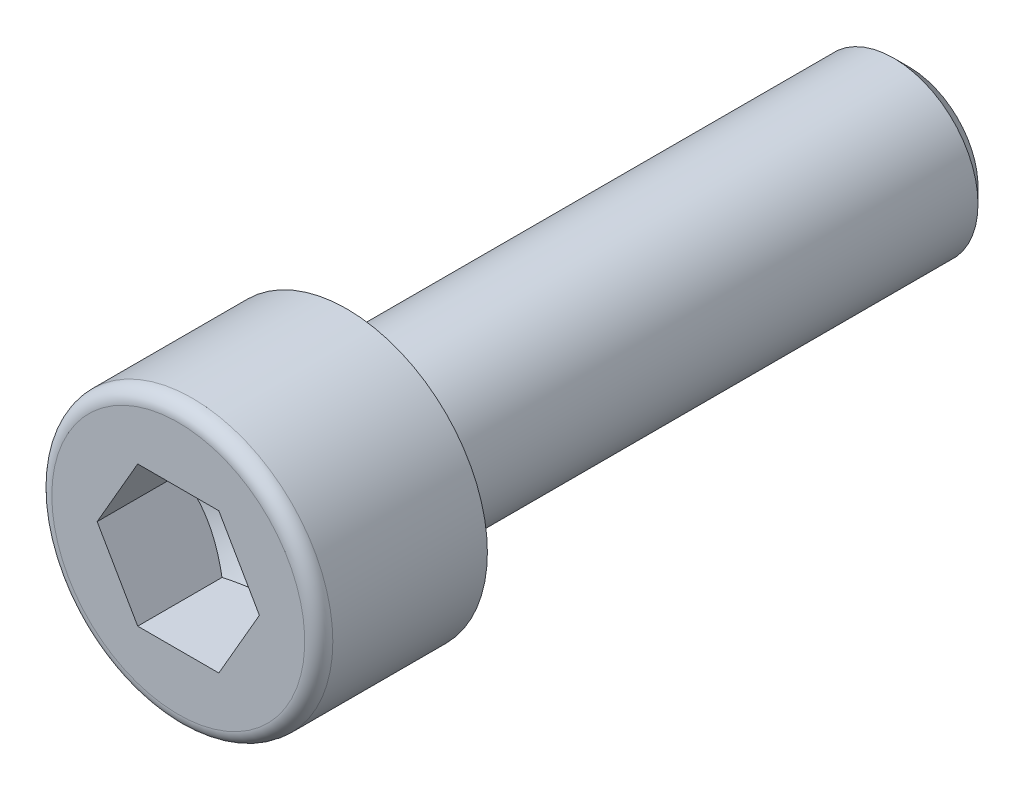
ISO-10303-21;
HEADER;
FILE_DESCRIPTION(('STEP AP214'),'2;1');
FILE_NAME('part.step','',(''),(''),'','','');
FILE_SCHEMA(('AUTOMOTIVE_DESIGN { 1 0 10303 214 1 1 1 1 }'));
ENDSEC;
DATA;
#1=APPLICATION_CONTEXT('core data for automotive mechanical design processes');
#2=APPLICATION_PROTOCOL_DEFINITION('international standard','automotive_design',2000,#1);
#3=PRODUCT_CONTEXT('',#1,'mechanical');
#4=PRODUCT('Part','Part','',(#3));
#5=PRODUCT_RELATED_PRODUCT_CATEGORY('part','',(#4));
#6=PRODUCT_DEFINITION_FORMATION('','',#4);
#7=PRODUCT_DEFINITION_CONTEXT('part definition',#1,'design');
#8=PRODUCT_DEFINITION('design','',#6,#7);
#9=PRODUCT_DEFINITION_SHAPE('','',#8);
#10=(LENGTH_UNIT() NAMED_UNIT(*) SI_UNIT(.MILLI.,.METRE.));
#11=(NAMED_UNIT(*) PLANE_ANGLE_UNIT() SI_UNIT($,.RADIAN.));
#12=(NAMED_UNIT(*) SI_UNIT($,.STERADIAN.) SOLID_ANGLE_UNIT());
#13=UNCERTAINTY_MEASURE_WITH_UNIT(LENGTH_MEASURE(1.E-05),#10,'distance_accuracy_value','');
#14=(GEOMETRIC_REPRESENTATION_CONTEXT(3) GLOBAL_UNCERTAINTY_ASSIGNED_CONTEXT((#13)) GLOBAL_UNIT_ASSIGNED_CONTEXT((#10,
#11,#12)) REPRESENTATION_CONTEXT('',''));
#15=CARTESIAN_POINT('',(0.,0.,0.));
#16=DIRECTION('',(0.,0.,1.));
#17=DIRECTION('',(1.,0.,0.));
#18=AXIS2_PLACEMENT_3D('',#15,#16,#17);
#19=CARTESIAN_POINT('',(0.,0.,0.));
#20=DIRECTION('',(0.,0.,1.));
#21=DIRECTION('',(1.,0.,0.));
#22=AXIS2_PLACEMENT_3D('',#19,#20,#21);
#23=PLANE('',#22);
#24=CARTESIAN_POINT('',(0.,0.,0.));
#25=DIRECTION('',(0.,0.,1.));
#26=DIRECTION('',(1.,0.,0.));
#27=AXIS2_PLACEMENT_3D('',#24,#25,#26);
#28=CIRCLE('',#27,5.);
#29=CARTESIAN_POINT('',(5.,0.,0.));
#30=VERTEX_POINT('',#29);
#31=EDGE_CURVE('E146',#30,#30,#28,.T.);
#32=ORIENTED_EDGE('',*,*,#31,.F.);
#33=EDGE_LOOP('',(#32));
#34=FACE_BOUND('',#33,.T.);
#35=CARTESIAN_POINT('',(0.,0.,0.));
#36=DIRECTION('',(0.,0.,1.));
#37=DIRECTION('',(1.,0.,0.));
#38=AXIS2_PLACEMENT_3D('',#35,#36,#37);
#39=CIRCLE('',#38,3.);
#40=CARTESIAN_POINT('',(3.,0.,0.));
#41=VERTEX_POINT('',#40);
#42=EDGE_CURVE('E151',#41,#41,#39,.F.);
#43=ORIENTED_EDGE('',*,*,#42,.F.);
#44=EDGE_LOOP('',(#43));
#45=FACE_BOUND('',#44,.T.);
#46=ADVANCED_FACE('F43',(#34,#45),#23,.F.);
#47=CARTESIAN_POINT('',(0.,4.5,6.));
#48=DIRECTION('',(0.,0.,-1.));
#49=DIRECTION('',(-1.,0.,0.));
#50=AXIS2_PLACEMENT_3D('',#47,#48,#49);
#51=PLANE('',#50);
#52=CARTESIAN_POINT('',(0.,0.,6.));
#53=DIRECTION('',(0.,0.,-1.));
#54=DIRECTION('',(-1.,0.,0.));
#55=AXIS2_PLACEMENT_3D('',#52,#53,#54);
#56=CIRCLE('',#55,4.5);
#57=CARTESIAN_POINT('',(-4.5,0.,6.));
#58=VERTEX_POINT('',#57);
#59=EDGE_CURVE('E51',#58,#58,#56,.F.);
#60=ORIENTED_EDGE('',*,*,#59,.T.);
#61=EDGE_LOOP('',(#60));
#62=FACE_BOUND('',#61,.T.);
#63=DIRECTION('',(0.5,-0.866025403784439,0.));
#64=VECTOR('',#63,1.);
#65=CARTESIAN_POINT('',(1.443375,2.49999883437473,6.));
#66=LINE('',#65,#64);
#67=CARTESIAN_POINT('',(1.443375,2.49999883437473,6.));
#68=VERTEX_POINT('',#67);
#69=CARTESIAN_POINT('',(2.88675,0.,6.));
#70=VERTEX_POINT('',#69);
#71=EDGE_CURVE('E58',#68,#70,#66,.T.);
#72=ORIENTED_EDGE('',*,*,#71,.T.);
#73=DIRECTION('',(-0.5,-0.866025403784439,0.));
#74=VECTOR('',#73,1.);
#75=CARTESIAN_POINT('',(2.88675,0.,6.));
#76=LINE('',#75,#74);
#77=CARTESIAN_POINT('',(1.443375,-2.49999883437473,6.));
#78=VERTEX_POINT('',#77);
#79=EDGE_CURVE('E175',#70,#78,#76,.T.);
#80=ORIENTED_EDGE('',*,*,#79,.T.);
#81=DIRECTION('',(-1.,0.,0.));
#82=VECTOR('',#81,1.);
#83=CARTESIAN_POINT('',(1.443375,-2.49999883437473,6.));
#84=LINE('',#83,#82);
#85=CARTESIAN_POINT('',(-1.443375,-2.49999883437473,6.));
#86=VERTEX_POINT('',#85);
#87=EDGE_CURVE('E271',#78,#86,#84,.T.);
#88=ORIENTED_EDGE('',*,*,#87,.T.);
#89=DIRECTION('',(-0.5,0.866025403784439,0.));
#90=VECTOR('',#89,1.);
#91=CARTESIAN_POINT('',(-1.443375,-2.49999883437473,6.));
#92=LINE('',#91,#90);
#93=CARTESIAN_POINT('',(-2.88675,0.,6.));
#94=VERTEX_POINT('',#93);
#95=EDGE_CURVE('E275',#86,#94,#92,.T.);
#96=ORIENTED_EDGE('',*,*,#95,.T.);
#97=DIRECTION('',(0.5,0.866025403784439,0.));
#98=VECTOR('',#97,1.);
#99=CARTESIAN_POINT('',(-2.88675,0.,6.));
#100=LINE('',#99,#98);
#101=CARTESIAN_POINT('',(-1.443375,2.49999883437473,6.));
#102=VERTEX_POINT('',#101);
#103=EDGE_CURVE('E130',#94,#102,#100,.T.);
#104=ORIENTED_EDGE('',*,*,#103,.T.);
#105=DIRECTION('',(1.,0.,0.));
#106=VECTOR('',#105,1.);
#107=CARTESIAN_POINT('',(-1.443375,2.49999883437473,6.));
#108=LINE('',#107,#106);
#109=EDGE_CURVE('E122',#102,#68,#108,.T.);
#110=ORIENTED_EDGE('',*,*,#109,.T.);
#111=EDGE_LOOP('',(#72,#80,#88,#96,#104,#110));
#112=FACE_BOUND('',#111,.T.);
#113=ADVANCED_FACE('F230',(#62,#112),#51,.F.);
#114=CARTESIAN_POINT('',(0.,0.,6.));
#115=DIRECTION('',(0.,0.,1.));
#116=DIRECTION('',(1.,0.,0.));
#117=AXIS2_PLACEMENT_3D('',#114,#115,#116);
#118=CYLINDRICAL_SURFACE('',#117,5.);
#119=CARTESIAN_POINT('',(0.,0.,5.5));
#120=DIRECTION('',(0.,0.,-1.));
#121=DIRECTION('',(-1.,0.,0.));
#122=AXIS2_PLACEMENT_3D('',#119,#120,#121);
#123=CIRCLE('',#122,5.);
#124=CARTESIAN_POINT('',(-5.,0.,5.5));
#125=VERTEX_POINT('',#124);
#126=EDGE_CURVE('E12',#125,#125,#123,.T.);
#127=ORIENTED_EDGE('',*,*,#126,.T.);
#128=EDGE_LOOP('',(#127));
#129=FACE_BOUND('',#128,.T.);
#130=ORIENTED_EDGE('',*,*,#31,.T.);
#131=EDGE_LOOP('',(#130));
#132=FACE_BOUND('',#131,.T.);
#133=ADVANCED_FACE('F228',(#129,#132),#118,.T.);
#134=CARTESIAN_POINT('',(1.443375,2.49999883437473,1.33333411041685));
#135=DIRECTION('',(-0.866025403784439,-0.5,0.));
#136=DIRECTION('',(-0.5,0.866025403784438,0.));
#137=AXIS2_PLACEMENT_3D('',#134,#135,#136);
#138=PLANE('',#137);
#139=DIRECTION('',(0.,0.,1.));
#140=VECTOR('',#139,1.);
#141=CARTESIAN_POINT('',(2.88675,0.,1.33333411041685));
#142=LINE('',#141,#140);
#143=CARTESIAN_POINT('',(2.88675,0.,3.));
#144=VERTEX_POINT('',#143);
#145=EDGE_CURVE('E143',#144,#70,#142,.T.);
#146=ORIENTED_EDGE('',*,*,#145,.T.);
#147=ORIENTED_EDGE('',*,*,#71,.F.);
#148=DIRECTION('',(0.,0.,1.));
#149=VECTOR('',#148,1.);
#150=CARTESIAN_POINT('',(1.443375,2.49999883437473,1.33333411041685));
#151=LINE('',#150,#149);
#152=CARTESIAN_POINT('',(1.443375,2.49999883437473,3.));
#153=VERTEX_POINT('',#152);
#154=EDGE_CURVE('E115',#153,#68,#151,.T.);
#155=ORIENTED_EDGE('',*,*,#154,.F.);
#156=CARTESIAN_POINT('',(2.88675115470054,-2.E-06,3.00000066666707));
#157=CARTESIAN_POINT('',(2.82332354535897,0.109857841982227,2.96337006039726));
#158=CARTESIAN_POINT('',(2.75934842983882,0.220665992483223,2.93005643273496));
#159=CARTESIAN_POINT('',(2.63029051087885,0.444200865240994,2.87190847700775));
#160=CARTESIAN_POINT('',(2.56520541506427,0.556931558007335,2.84709471727335));
#161=CARTESIAN_POINT('',(2.4358417909861,0.78099592756197,2.8084702850323));
#162=CARTESIAN_POINT('',(2.37158316147789,0.892295138694932,2.79440251599447));
#163=CARTESIAN_POINT('',(2.24276369983448,1.11541699126498,2.77761163079658));
#164=CARTESIAN_POINT('',(2.17820333560637,1.22723882226323,2.77487460704407));
#165=CARTESIAN_POINT('',(2.05757906871724,1.43616618114094,2.7805828840092));
#166=CARTESIAN_POINT('',(2.00149706603362,1.53330305917919,2.78762661346734));
#167=CARTESIAN_POINT('',(1.88969841687931,1.72694399973201,2.8099466525033));
#168=CARTESIAN_POINT('',(1.83398215680598,1.82344739298676,2.82523057920943));
#169=CARTESIAN_POINT('',(1.72195318911858,2.01748725694082,2.86343746342627));
#170=CARTESIAN_POINT('',(1.66565465323697,2.1149991814795,2.88652230296935));
#171=CARTESIAN_POINT('',(1.55389703460282,2.30856905508676,2.93891513912548));
#172=CARTESIAN_POINT('',(1.49843652119396,2.40462948212476,2.96821083329068));
#173=CARTESIAN_POINT('',(1.44337384529946,2.50000083437473,3.00000066666707));
#174=B_SPLINE_CURVE_WITH_KNOTS('',3,(#156,#157,#158,#159,#160,#161,#162,#163,#164,#165,#166,
#167,#168,#169,#170,#171,#172,#173),.UNSPECIFIED.,.F.,.F.,(4,2,2,2,2,2,2,2,4),(0.,
0.396269987805477,0.793492221888839,1.1808844206854,1.56780098500208,1.90463546712439,
2.24178184973835,2.58640455505215,2.93035090593904),.UNSPECIFIED.);
#175=EDGE_CURVE('E107',#144,#153,#174,.T.);
#176=ORIENTED_EDGE('',*,*,#175,.F.);
#177=EDGE_LOOP('',(#146,#147,#155,#176));
#178=FACE_BOUND('',#177,.T.);
#179=ADVANCED_FACE('F116',(#178),#138,.T.);
#180=CARTESIAN_POINT('',(2.88675,0.,1.33333411041685));
#181=DIRECTION('',(-0.866025403784439,0.5,0.));
#182=DIRECTION('',(0.5,0.866025403784439,0.));
#183=AXIS2_PLACEMENT_3D('',#180,#181,#182);
#184=PLANE('',#183);
#185=DIRECTION('',(0.,0.,1.));
#186=VECTOR('',#185,1.);
#187=CARTESIAN_POINT('',(1.443375,-2.49999883437473,1.33333411041685));
#188=LINE('',#187,#186);
#189=CARTESIAN_POINT('',(1.443375,-2.49999883437473,3.));
#190=VERTEX_POINT('',#189);
#191=EDGE_CURVE('E140',#190,#78,#188,.T.);
#192=ORIENTED_EDGE('',*,*,#191,.T.);
#193=ORIENTED_EDGE('',*,*,#79,.F.);
#194=ORIENTED_EDGE('',*,*,#145,.F.);
#195=CARTESIAN_POINT('',(1.44337384529946,-2.50000083437473,3.00000066666707));
#196=CARTESIAN_POINT('',(1.50680145464103,-2.3901409923925,2.96337006039726));
#197=CARTESIAN_POINT('',(1.57077657016118,-2.27933284189151,2.93005643273496));
#198=CARTESIAN_POINT('',(1.69983448912115,-2.05579796913373,2.87190847700775));
#199=CARTESIAN_POINT('',(1.76491958493573,-1.94306727636739,2.84709471727335));
#200=CARTESIAN_POINT('',(1.8942832090139,-1.71900290681276,2.8084702850323));
#201=CARTESIAN_POINT('',(1.95854183852211,-1.6077036956798,2.79440251599447));
#202=CARTESIAN_POINT('',(2.08736130016552,-1.38458184310974,2.77761163079658));
#203=CARTESIAN_POINT('',(2.15192166439363,-1.2727600121115,2.77487460704408));
#204=CARTESIAN_POINT('',(2.27254593128276,-1.06383265323379,2.7805828840092));
#205=CARTESIAN_POINT('',(2.32862793396638,-0.966695775195541,2.78762661346734));
#206=CARTESIAN_POINT('',(2.44042658312069,-0.773054834642715,2.8099466525033));
#207=CARTESIAN_POINT('',(2.49614284319403,-0.676551441387972,2.82523057920943));
#208=CARTESIAN_POINT('',(2.60817181088142,-0.482511577433911,2.86343746342627));
#209=CARTESIAN_POINT('',(2.66447034676303,-0.384999652895224,2.88652230296935));
#210=CARTESIAN_POINT('',(2.77622796539718,-0.191429779287974,2.93891513912548));
#211=CARTESIAN_POINT('',(2.83168847880604,-0.0953693522499732,2.96821083329068));
#212=CARTESIAN_POINT('',(2.88675115470054,2.00000000025213E-06,3.00000066666707));
#213=B_SPLINE_CURVE_WITH_KNOTS('',3,(#195,#196,#197,#198,#199,#200,#201,#202,#203,#204,#205,
#206,#207,#208,#209,#210,#211,#212),.UNSPECIFIED.,.F.,.F.,(4,2,2,2,2,2,2,2,4),(0.,
0.396269987805478,0.79349222188884,1.1808844206854,1.56780098500208,1.90463546712439,
2.24178184973836,2.58640455505215,2.93035090593904),.UNSPECIFIED.);
#214=EDGE_CURVE('E111',#190,#144,#213,.T.);
#215=ORIENTED_EDGE('',*,*,#214,.F.);
#216=EDGE_LOOP('',(#192,#193,#194,#215));
#217=FACE_BOUND('',#216,.T.);
#218=ADVANCED_FACE('F219',(#217),#184,.T.);
#219=CARTESIAN_POINT('',(1.443375,-2.49999883437473,1.33333411041685));
#220=DIRECTION('',(0.,1.,0.));
#221=DIRECTION('',(1.,0.,0.));
#222=AXIS2_PLACEMENT_3D('',#219,#220,#221);
#223=PLANE('',#222);
#224=DIRECTION('',(0.,0.,1.));
#225=VECTOR('',#224,1.);
#226=CARTESIAN_POINT('',(-1.443375,-2.49999883437473,1.33333411041685));
#227=LINE('',#226,#225);
#228=CARTESIAN_POINT('',(-1.443375,-2.49999883437473,3.));
#229=VERTEX_POINT('',#228);
#230=EDGE_CURVE('E137',#229,#86,#227,.T.);
#231=ORIENTED_EDGE('',*,*,#230,.T.);
#232=ORIENTED_EDGE('',*,*,#87,.F.);
#233=ORIENTED_EDGE('',*,*,#191,.F.);
#234=CARTESIAN_POINT('',(-3.73786106214979,-2.49999883437473,3.92958778907324));
#235=CARTESIAN_POINT('',(-3.62990250335969,-2.49999883437473,3.87779335774325));
#236=CARTESIAN_POINT('',(-3.52168094276801,-2.49999883437473,3.82653690477121));
#237=CARTESIAN_POINT('',(-3.30457164494513,-2.49999883437473,3.72540514162743));
#238=CARTESIAN_POINT('',(-3.19568379207403,-2.49999883437473,3.67553008001432));
#239=CARTESIAN_POINT('',(-2.9764774054262,-2.49999883437473,3.57718765766728));
#240=CARTESIAN_POINT('',(-2.86615419981139,-2.49999883437473,3.52873067133896));
#241=CARTESIAN_POINT('',(-2.64458202847932,-2.49999883437473,3.4339896311619));
#242=CARTESIAN_POINT('',(-2.53333311125245,-2.49999883437473,3.38770546433014));
#243=CARTESIAN_POINT('',(-2.30680205819545,-2.49999883437473,3.2967100755852));
#244=CARTESIAN_POINT('',(-2.19149052050016,-2.49999883437473,3.2520716190807));
#245=CARTESIAN_POINT('',(-1.95947266398433,-2.49999883437473,3.1665059843482));
#246=CARTESIAN_POINT('',(-1.84276618516189,-2.49999883437473,3.12557923657333));
#247=CARTESIAN_POINT('',(-1.60804233924781,-2.49999883437473,3.04860739009266));
#248=CARTESIAN_POINT('',(-1.49002871456052,-2.49999883437473,3.01255100191558));
#249=CARTESIAN_POINT('',(-1.25231014409633,-2.49999883437473,2.94655294839667));
#250=CARTESIAN_POINT('',(-1.13260562628878,-2.49999883437473,2.91660976441946));
#251=CARTESIAN_POINT('',(-0.891754624847682,-2.49999883437473,2.86443431611274));
#252=CARTESIAN_POINT('',(-0.770611640017906,-2.49999883437473,2.84218621451804));
#253=CARTESIAN_POINT('',(-0.526970339246118,-2.49999883437473,2.8068577746921));
#254=CARTESIAN_POINT('',(-0.404472115461951,-2.49999883437473,2.79377681692952));
#255=CARTESIAN_POINT('',(-0.160266323051493,-2.49999883437473,2.7779963214066));
#256=CARTESIAN_POINT('',(-0.0385668667227562,-2.49999883437473,2.77517427588141));
#257=CARTESIAN_POINT('',(0.204641816788917,-2.49999883437473,2.77983589012324));
#258=CARTESIAN_POINT('',(0.326151031726512,-2.49999883437473,2.78732018801759));
#259=CARTESIAN_POINT('',(0.536550258909014,-2.49999883437473,2.80869871352845));
#260=CARTESIAN_POINT('',(0.62567290534766,-2.49999883437473,2.82040889034712));
#261=CARTESIAN_POINT('',(0.80317291802574,-2.49999883437473,2.84856827951529));
#262=CARTESIAN_POINT('',(0.89155015258231,-2.49999883437473,2.86501831186796));
#263=CARTESIAN_POINT('',(1.15551819105506,-2.49999883437473,2.920608175745));
#264=CARTESIAN_POINT('',(1.32980784141715,-2.49999883437473,2.96597208143992));
#265=CARTESIAN_POINT('',(1.59042319619559,-2.49999883437473,3.04347409361569));
#266=CARTESIAN_POINT('',(1.6781227038712,-2.49999883437473,3.07124565241289));
#267=CARTESIAN_POINT('',(1.85261386594625,-2.49999883437473,3.12935698644029));
#268=CARTESIAN_POINT('',(1.93940604944137,-2.49999883437473,3.15969515890171));
#269=CARTESIAN_POINT('',(2.11219208096506,-2.49999883437473,3.2225001255257));
#270=CARTESIAN_POINT('',(2.19818607085344,-2.49999883437473,3.25496653284332));
#271=CARTESIAN_POINT('',(2.36949689943691,-2.49999883437473,3.32167630023758));
#272=CARTESIAN_POINT('',(2.4548136208992,-2.49999883437473,3.35591996053755));
#273=CARTESIAN_POINT('',(2.6725866434786,-2.49999883437473,3.44552247380957));
#274=CARTESIAN_POINT('',(2.80460719164756,-2.49999883437473,3.50193903020824));
#275=CARTESIAN_POINT('',(3.06745887456859,-2.49999883437473,3.61748626069377));
#276=CARTESIAN_POINT('',(3.19828991933625,-2.49999883437473,3.6766171381022));
#277=CARTESIAN_POINT('',(3.4590085358823,-2.49999883437473,3.79697662160321));
#278=CARTESIAN_POINT('',(3.58889593921384,-2.49999883437473,3.85820559158554));
#279=CARTESIAN_POINT('',(3.84788850349047,-2.49999883437473,3.98229871528446));
#280=CARTESIAN_POINT('',(3.97699364696087,-2.49999883437473,4.04516290536492));
#281=CARTESIAN_POINT('',(4.36366797006391,-2.49999883437473,4.23583166126771));
#282=CARTESIAN_POINT('',(4.62028446759073,-2.49999883437473,4.36556642178983));
#283=CARTESIAN_POINT('',(5.13176042686128,-2.49999883437473,4.62835386929467));
#284=CARTESIAN_POINT('',(5.38662010673858,-2.49999883437473,4.76140613453321));
#285=CARTESIAN_POINT('',(5.87112459117811,-2.49999883437473,5.01714634418064));
#286=CARTESIAN_POINT('',(6.10087887005075,-2.49999883437473,5.13962722061171));
#287=CARTESIAN_POINT('',(6.55964844430519,-2.49999883437473,5.38598343470431));
#288=CARTESIAN_POINT('',(6.78866371193351,-2.49999883437473,5.50985882397014));
#289=CARTESIAN_POINT('',(7.2455430452267,-2.49999883437473,5.75833902928913));
#290=CARTESIAN_POINT('',(7.47340855738404,-2.49999883437473,5.88294118863516));
#291=CARTESIAN_POINT('',(7.9286788902648,-2.49999883437473,6.13295649095833));
#292=CARTESIAN_POINT('',(8.156083734473,-2.49999883437473,6.25836959115399));
#293=CARTESIAN_POINT('',(8.38332307978598,-2.49999883437473,6.38407993098458));
#294=B_SPLINE_CURVE_WITH_KNOTS('',3,(#234,#235,#236,#237,#238,#239,#240,#241,#242,#243,#244,
#245,#246,#247,#248,#249,#250,#251,#252,#253,#254,#255,#256,#257,#258,#259,#260,#261,#262,#263,
#264,#265,#266,#267,#268,#269,#270,#271,#272,#273,#274,#275,#276,#277,#278,#279,#280,#281,#282,
#283,#284,#285,#286,#287,#288,#289,#290,#291,#292,#293),.UNSPECIFIED.,.F.,.F.,(4,2,2,2,2,2,2,2,
2,2,2,2,2,2,2,2,2,2,2,2,2,2,2,2,2,2,2,2,2,4),(0.,0.359225681612437,0.718515585501186,
1.07998495471943,1.44143550726446,1.81233642992121,2.18328031172541,2.553349025072,
2.92332569419794,3.29253631826214,3.66172198803058,4.02648423639168,4.39126907037958,
4.66080188357842,4.93038135444365,5.4699536049164,5.74590907322745,6.02169347043866,
6.29742787713709,6.57320901498075,7.00387400010299,7.43457129784687,7.86534367692857,
8.29612564369277,9.15872160396268,10.0212084586034,10.8022892260896,11.5833989933082,
12.3625220011586,13.1416042361018),.UNSPECIFIED.);
#295=EDGE_CURVE('E208',#229,#190,#294,.T.);
#296=ORIENTED_EDGE('',*,*,#295,.F.);
#297=EDGE_LOOP('',(#231,#232,#233,#296));
#298=FACE_BOUND('',#297,.T.);
#299=ADVANCED_FACE('F215',(#298),#223,.T.);
#300=CARTESIAN_POINT('',(-1.443375,-2.49999883437473,1.33333411041685));
#301=DIRECTION('',(0.866025403784439,0.5,0.));
#302=DIRECTION('',(0.5,-0.866025403784439,0.));
#303=AXIS2_PLACEMENT_3D('',#300,#301,#302);
#304=PLANE('',#303);
#305=DIRECTION('',(0.,0.,1.));
#306=VECTOR('',#305,1.);
#307=CARTESIAN_POINT('',(-2.88675,0.,1.33333411041685));
#308=LINE('',#307,#306);
#309=CARTESIAN_POINT('',(-2.88675,0.,3.));
#310=VERTEX_POINT('',#309);
#311=EDGE_CURVE('E128',#310,#94,#308,.T.);
#312=ORIENTED_EDGE('',*,*,#311,.T.);
#313=ORIENTED_EDGE('',*,*,#95,.F.);
#314=ORIENTED_EDGE('',*,*,#230,.F.);
#315=CARTESIAN_POINT('',(-2.88675115470054,2.00000000083267E-06,3.00000066666707));
#316=CARTESIAN_POINT('',(-2.82332354535897,-0.109857841982226,2.96337006039727));
#317=CARTESIAN_POINT('',(-2.75934842983882,-0.220665992483222,2.93005643273496));
#318=CARTESIAN_POINT('',(-2.63029051087885,-0.444200865240993,2.87190847700775));
#319=CARTESIAN_POINT('',(-2.56520541506427,-0.556931558007334,2.84709471727335));
#320=CARTESIAN_POINT('',(-2.4358417909861,-0.780995927561968,2.8084702850323));
#321=CARTESIAN_POINT('',(-2.37158316147789,-0.89229513869493,2.79440251599447));
#322=CARTESIAN_POINT('',(-2.24276369983448,-1.11541699126498,2.77761163079658));
#323=CARTESIAN_POINT('',(-2.17820333560637,-1.22723882226323,2.77487460704408));
#324=CARTESIAN_POINT('',(-2.05757906871724,-1.43616618114094,2.7805828840092));
#325=CARTESIAN_POINT('',(-2.00149706603362,-1.53330305917919,2.78762661346734));
#326=CARTESIAN_POINT('',(-1.88969841687931,-1.72694399973201,2.8099466525033));
#327=CARTESIAN_POINT('',(-1.83398215680598,-1.82344739298676,2.82523057920943));
#328=CARTESIAN_POINT('',(-1.72195318911858,-2.01748725694082,2.86343746342627));
#329=CARTESIAN_POINT('',(-1.66565465323697,-2.1149991814795,2.88652230296935));
#330=CARTESIAN_POINT('',(-1.55389703460282,-2.30856905508676,2.93891513912548));
#331=CARTESIAN_POINT('',(-1.49843652119396,-2.40462948212476,2.96821083329068));
#332=CARTESIAN_POINT('',(-1.44337384529946,-2.50000083437473,3.00000066666707));
#333=B_SPLINE_CURVE_WITH_KNOTS('',3,(#315,#316,#317,#318,#319,#320,#321,#322,#323,#324,#325,
#326,#327,#328,#329,#330,#331,#332),.UNSPECIFIED.,.F.,.F.,(4,2,2,2,2,2,2,2,4),(0.,
0.396269987805478,0.793492221888839,1.1808844206854,1.56780098500208,1.90463546712439,
2.24178184973836,2.58640455505215,2.93035090593905),.UNSPECIFIED.);
#334=EDGE_CURVE('E202',#310,#229,#333,.T.);
#335=ORIENTED_EDGE('',*,*,#334,.F.);
#336=EDGE_LOOP('',(#312,#313,#314,#335));
#337=FACE_BOUND('',#336,.T.);
#338=ADVANCED_FACE('F218',(#337),#304,.T.);
#339=CARTESIAN_POINT('',(-2.88675,0.,1.33333411041685));
#340=DIRECTION('',(0.866025403784439,-0.5,0.));
#341=DIRECTION('',(-0.5,-0.866025403784439,0.));
#342=AXIS2_PLACEMENT_3D('',#339,#340,#341);
#343=PLANE('',#342);
#344=DIRECTION('',(0.,0.,1.));
#345=VECTOR('',#344,1.);
#346=CARTESIAN_POINT('',(-1.443375,2.49999883437473,1.33333411041685));
#347=LINE('',#346,#345);
#348=CARTESIAN_POINT('',(-1.443375,2.49999883437473,3.));
#349=VERTEX_POINT('',#348);
#350=EDGE_CURVE('E121',#349,#102,#347,.T.);
#351=ORIENTED_EDGE('',*,*,#350,.T.);
#352=ORIENTED_EDGE('',*,*,#103,.F.);
#353=ORIENTED_EDGE('',*,*,#311,.F.);
#354=CARTESIAN_POINT('',(-1.44337384529946,2.50000083437473,3.00000066666707));
#355=CARTESIAN_POINT('',(-1.50680145464103,2.3901409923925,2.96337006039726));
#356=CARTESIAN_POINT('',(-1.57077657016118,2.27933284189151,2.93005643273496));
#357=CARTESIAN_POINT('',(-1.69983448912115,2.05579796913373,2.87190847700775));
#358=CARTESIAN_POINT('',(-1.76491958493573,1.94306727636739,2.84709471727335));
#359=CARTESIAN_POINT('',(-1.8942832090139,1.71900290681276,2.8084702850323));
#360=CARTESIAN_POINT('',(-1.95854183852211,1.6077036956798,2.79440251599447));
#361=CARTESIAN_POINT('',(-2.08736130016552,1.38458184310974,2.77761163079658));
#362=CARTESIAN_POINT('',(-2.15192166439363,1.2727600121115,2.77487460704408));
#363=CARTESIAN_POINT('',(-2.27254593128276,1.06383265323379,2.7805828840092));
#364=CARTESIAN_POINT('',(-2.32862793396638,0.966695775195541,2.78762661346734));
#365=CARTESIAN_POINT('',(-2.44042658312069,0.773054834642715,2.8099466525033));
#366=CARTESIAN_POINT('',(-2.49614284319402,0.676551441387972,2.82523057920943));
#367=CARTESIAN_POINT('',(-2.60817181088142,0.482511577433911,2.86343746342627));
#368=CARTESIAN_POINT('',(-2.66447034676303,0.384999652895224,2.88652230296935));
#369=CARTESIAN_POINT('',(-2.77622796539718,0.191429779287974,2.93891513912548));
#370=CARTESIAN_POINT('',(-2.83168847880604,0.0953693522499737,2.96821083329068));
#371=CARTESIAN_POINT('',(-2.88675115470054,-1.9999999995853E-06,3.00000066666707));
#372=B_SPLINE_CURVE_WITH_KNOTS('',3,(#354,#355,#356,#357,#358,#359,#360,#361,#362,#363,#364,
#365,#366,#367,#368,#369,#370,#371),.UNSPECIFIED.,.F.,.F.,(4,2,2,2,2,2,2,2,4),(0.,
0.396269987805478,0.79349222188884,1.1808844206854,1.56780098500208,1.90463546712439,
2.24178184973835,2.58640455505215,2.93035090593904),.UNSPECIFIED.);
#373=EDGE_CURVE('E66',#349,#310,#372,.T.);
#374=ORIENTED_EDGE('',*,*,#373,.F.);
#375=EDGE_LOOP('',(#351,#352,#353,#374));
#376=FACE_BOUND('',#375,.T.);
#377=ADVANCED_FACE('F297',(#376),#343,.T.);
#378=CARTESIAN_POINT('',(-1.443375,2.49999883437473,1.33333411041685));
#379=DIRECTION('',(0.,-1.,0.));
#380=DIRECTION('',(-1.,0.,0.));
#381=AXIS2_PLACEMENT_3D('',#378,#379,#380);
#382=PLANE('',#381);
#383=ORIENTED_EDGE('',*,*,#154,.T.);
#384=ORIENTED_EDGE('',*,*,#109,.F.);
#385=ORIENTED_EDGE('',*,*,#350,.F.);
#386=CARTESIAN_POINT('',(-3.73786106214979,2.49999883437473,3.92958778907324));
#387=CARTESIAN_POINT('',(-3.62990250335969,2.49999883437473,3.87779335774325));
#388=CARTESIAN_POINT('',(-3.52168094276801,2.49999883437473,3.82653690477121));
#389=CARTESIAN_POINT('',(-3.30457164494513,2.49999883437473,3.72540514162743));
#390=CARTESIAN_POINT('',(-3.19568379207404,2.49999883437473,3.67553008001432));
#391=CARTESIAN_POINT('',(-2.9764774054262,2.49999883437473,3.57718765766728));
#392=CARTESIAN_POINT('',(-2.86615419981139,2.49999883437473,3.52873067133896));
#393=CARTESIAN_POINT('',(-2.64458202847932,2.49999883437473,3.4339896311619));
#394=CARTESIAN_POINT('',(-2.53333311125245,2.49999883437473,3.38770546433014));
#395=CARTESIAN_POINT('',(-2.30680205819545,2.49999883437473,3.2967100755852));
#396=CARTESIAN_POINT('',(-2.19149052050016,2.49999883437473,3.2520716190807));
#397=CARTESIAN_POINT('',(-1.95947266398433,2.49999883437473,3.1665059843482));
#398=CARTESIAN_POINT('',(-1.8427661851619,2.49999883437473,3.12557923657333));
#399=CARTESIAN_POINT('',(-1.60804233924781,2.49999883437473,3.04860739009266));
#400=CARTESIAN_POINT('',(-1.49002871456052,2.49999883437473,3.01255100191558));
#401=CARTESIAN_POINT('',(-1.25231014409633,2.49999883437473,2.94655294839667));
#402=CARTESIAN_POINT('',(-1.13260562628879,2.49999883437473,2.91660976441946));
#403=CARTESIAN_POINT('',(-0.891754624847686,2.49999883437473,2.86443431611274));
#404=CARTESIAN_POINT('',(-0.770611640017909,2.49999883437473,2.84218621451804));
#405=CARTESIAN_POINT('',(-0.526970339246121,2.49999883437473,2.8068577746921));
#406=CARTESIAN_POINT('',(-0.404472115461954,2.49999883437473,2.79377681692952));
#407=CARTESIAN_POINT('',(-0.160266323051496,2.49999883437473,2.7779963214066));
#408=CARTESIAN_POINT('',(-0.0385668667227587,2.49999883437473,2.77517427588141));
#409=CARTESIAN_POINT('',(0.204641816788915,2.49999883437473,2.77983589012324));
#410=CARTESIAN_POINT('',(0.326151031726511,2.49999883437473,2.78732018801759));
#411=CARTESIAN_POINT('',(0.536550258909011,2.49999883437473,2.80869871352845));
#412=CARTESIAN_POINT('',(0.625672905347658,2.49999883437473,2.82040889034712));
#413=CARTESIAN_POINT('',(0.803172918025738,2.49999883437473,2.84856827951529));
#414=CARTESIAN_POINT('',(0.891550152582308,2.49999883437473,2.86501831186796));
#415=CARTESIAN_POINT('',(1.15551819105505,2.49999883437473,2.920608175745));
#416=CARTESIAN_POINT('',(1.32980784141715,2.49999883437473,2.96597208143992));
#417=CARTESIAN_POINT('',(1.59042319619558,2.49999883437473,3.04347409361569));
#418=CARTESIAN_POINT('',(1.6781227038712,2.49999883437473,3.07124565241289));
#419=CARTESIAN_POINT('',(1.85261386594624,2.49999883437473,3.12935698644029));
#420=CARTESIAN_POINT('',(1.93940604944136,2.49999883437473,3.15969515890171));
#421=CARTESIAN_POINT('',(2.11219208096505,2.49999883437473,3.2225001255257));
#422=CARTESIAN_POINT('',(2.19818607085344,2.49999883437473,3.25496653284332));
#423=CARTESIAN_POINT('',(2.36949689943691,2.49999883437473,3.32167630023758));
#424=CARTESIAN_POINT('',(2.45481362089919,2.49999883437473,3.35591996053755));
#425=CARTESIAN_POINT('',(2.6725866434786,2.49999883437473,3.44552247380957));
#426=CARTESIAN_POINT('',(2.80460719164756,2.49999883437473,3.50193903020824));
#427=CARTESIAN_POINT('',(3.06745887456859,2.49999883437473,3.61748626069377));
#428=CARTESIAN_POINT('',(3.19828991933624,2.49999883437473,3.6766171381022));
#429=CARTESIAN_POINT('',(3.45900853588229,2.49999883437473,3.79697662160321));
#430=CARTESIAN_POINT('',(3.58889593921384,2.49999883437473,3.85820559158554));
#431=CARTESIAN_POINT('',(3.84788850349046,2.49999883437473,3.98229871528446));
#432=CARTESIAN_POINT('',(3.97699364696087,2.49999883437473,4.04516290536492));
#433=CARTESIAN_POINT('',(4.3636679700639,2.49999883437473,4.23583166126771));
#434=CARTESIAN_POINT('',(4.62028446759072,2.49999883437473,4.36556642178983));
#435=CARTESIAN_POINT('',(5.13176042686127,2.49999883437473,4.62835386929467));
#436=CARTESIAN_POINT('',(5.38662010673857,2.49999883437473,4.7614061345332));
#437=CARTESIAN_POINT('',(5.8711245911781,2.49999883437473,5.01714634418064));
#438=CARTESIAN_POINT('',(6.10087887005074,2.49999883437473,5.13962722061171));
#439=CARTESIAN_POINT('',(6.55964844430518,2.49999883437473,5.38598343470431));
#440=CARTESIAN_POINT('',(6.7886637119335,2.49999883437473,5.50985882397013));
#441=CARTESIAN_POINT('',(7.24554304522669,2.49999883437473,5.75833902928913));
#442=CARTESIAN_POINT('',(7.47340855738403,2.49999883437474,5.88294118863516));
#443=CARTESIAN_POINT('',(7.92867889026479,2.49999883437474,6.13295649095833));
#444=CARTESIAN_POINT('',(8.15608373447299,2.49999883437474,6.25836959115399));
#445=CARTESIAN_POINT('',(8.38332307978597,2.49999883437473,6.38407993098458));
#446=B_SPLINE_CURVE_WITH_KNOTS('',3,(#386,#387,#388,#389,#390,#391,#392,#393,#394,#395,#396,
#397,#398,#399,#400,#401,#402,#403,#404,#405,#406,#407,#408,#409,#410,#411,#412,#413,#414,#415,
#416,#417,#418,#419,#420,#421,#422,#423,#424,#425,#426,#427,#428,#429,#430,#431,#432,#433,#434,
#435,#436,#437,#438,#439,#440,#441,#442,#443,#444,#445),.UNSPECIFIED.,.F.,.F.,(4,2,2,2,2,2,2,2,
2,2,2,2,2,2,2,2,2,2,2,2,2,2,2,2,2,2,2,2,2,4),(0.,0.359225681612436,0.718515585501185,
1.07998495471943,1.44143550726446,1.8123364299212,2.1832803117254,2.553349025072,
2.92332569419794,3.29253631826213,3.66172198803058,4.02648423639168,4.39126907037958,
4.66080188357842,4.93038135444365,5.4699536049164,5.74590907322745,6.02169347043866,
6.29742787713709,6.57320901498075,7.00387400010299,7.43457129784686,7.86534367692857,
8.29612564369276,9.15872160396267,10.0212084586034,10.8022892260895,11.5833989933082,
12.3625220011586,13.1416042361018),.UNSPECIFIED.);
#447=EDGE_CURVE('E108',#153,#349,#446,.F.);
#448=ORIENTED_EDGE('',*,*,#447,.F.);
#449=EDGE_LOOP('',(#383,#384,#385,#448));
#450=FACE_BOUND('',#449,.T.);
#451=ADVANCED_FACE('F103',(#450),#382,.T.);
#452=CARTESIAN_POINT('',(0.,0.,1.33333411041685));
#453=DIRECTION('',(0.,0.,1.));
#454=DIRECTION('',(1.,0.,0.));
#455=AXIS2_PLACEMENT_3D('',#452,#453,#454);
#456=CONICAL_SURFACE('',#455,0.,1.0471975511966);
#457=CARTESIAN_POINT('',(0.,0.,1.33333411041685));
#458=VERTEX_POINT('',#457);
#459=VERTEX_LOOP('',#458);
#460=FACE_BOUND('',#459,.T.);
#461=ORIENTED_EDGE('',*,*,#175,.T.);
#462=ORIENTED_EDGE('',*,*,#447,.T.);
#463=ORIENTED_EDGE('',*,*,#373,.T.);
#464=ORIENTED_EDGE('',*,*,#334,.T.);
#465=ORIENTED_EDGE('',*,*,#295,.T.);
#466=ORIENTED_EDGE('',*,*,#214,.T.);
#467=EDGE_LOOP('',(#461,#462,#463,#464,#465,#466));
#468=FACE_BOUND('',#467,.T.);
#469=ADVANCED_FACE('F99',(#460,#468),#456,.F.);
#470=CARTESIAN_POINT('',(0.,0.,-20.));
#471=DIRECTION('',(0.,0.,1.));
#472=DIRECTION('',(1.,0.,0.));
#473=AXIS2_PLACEMENT_3D('',#470,#471,#472);
#474=CYLINDRICAL_SURFACE('',#473,3.);
#475=CARTESIAN_POINT('',(0.,0.,-19.45875));
#476=DIRECTION('',(0.,0.,-1.));
#477=DIRECTION('',(-1.,0.,0.));
#478=AXIS2_PLACEMENT_3D('',#475,#476,#477);
#479=CIRCLE('',#478,3.);
#480=CARTESIAN_POINT('',(-3.,0.,-19.45875));
#481=VERTEX_POINT('',#480);
#482=EDGE_CURVE('E253',#481,#481,#479,.F.);
#483=ORIENTED_EDGE('',*,*,#482,.T.);
#484=EDGE_LOOP('',(#483));
#485=FACE_BOUND('',#484,.T.);
#486=ORIENTED_EDGE('',*,*,#42,.T.);
#487=EDGE_LOOP('',(#486));
#488=FACE_BOUND('',#487,.T.);
#489=ADVANCED_FACE('F102',(#485,#488),#474,.T.);
#490=CARTESIAN_POINT('',(0.,0.,-20.));
#491=DIRECTION('',(0.,0.,-1.));
#492=DIRECTION('',(-1.,0.,0.));
#493=AXIS2_PLACEMENT_3D('',#490,#491,#492);
#494=PLANE('',#493);
#495=CARTESIAN_POINT('',(0.,0.,-20.));
#496=DIRECTION('',(0.,0.,-1.));
#497=DIRECTION('',(-1.,0.,0.));
#498=AXIS2_PLACEMENT_3D('',#495,#496,#497);
#499=CIRCLE('',#498,2.45875);
#500=CARTESIAN_POINT('',(-2.45875,0.,-20.));
#501=VERTEX_POINT('',#500);
#502=EDGE_CURVE('E256',#501,#501,#499,.T.);
#503=ORIENTED_EDGE('',*,*,#502,.T.);
#504=EDGE_LOOP('',(#503));
#505=FACE_BOUND('',#504,.T.);
#506=ADVANCED_FACE('F242',(#505),#494,.T.);
#507=CARTESIAN_POINT('',(0.,0.,-20.));
#508=DIRECTION('',(0.,0.,1.));
#509=DIRECTION('',(1.,0.,0.));
#510=AXIS2_PLACEMENT_3D('',#507,#508,#509);
#511=CONICAL_SURFACE('',#510,2.45875,0.78539816339744);
#512=ORIENTED_EDGE('',*,*,#482,.F.);
#513=EDGE_LOOP('',(#512));
#514=FACE_BOUND('',#513,.T.);
#515=ORIENTED_EDGE('',*,*,#502,.F.);
#516=EDGE_LOOP('',(#515));
#517=FACE_BOUND('',#516,.T.);
#518=ADVANCED_FACE('F240',(#514,#517),#511,.T.);
#519=CARTESIAN_POINT('',(0.,0.,5.5));
#520=DIRECTION('',(0.,0.,-1.));
#521=DIRECTION('',(-1.,0.,0.));
#522=AXIS2_PLACEMENT_3D('',#519,#520,#521);
#523=TOROIDAL_SURFACE('',#522,4.5,0.5);
#524=ORIENTED_EDGE('',*,*,#126,.F.);
#525=EDGE_LOOP('',(#524));
#526=FACE_BOUND('',#525,.T.);
#527=ORIENTED_EDGE('',*,*,#59,.F.);
#528=EDGE_LOOP('',(#527));
#529=FACE_BOUND('',#528,.T.);
#530=ADVANCED_FACE('F45',(#526,#529),#523,.T.);
#531=CLOSED_SHELL('',(#46,#113,#133,#179,#218,#299,#338,#377,#451,#469,#489,#506,#518,#530));
#532=MANIFOLD_SOLID_BREP('B2',#531);
#533=ADVANCED_BREP_SHAPE_REPRESENTATION('',(#18,#532),#14);
#534=SHAPE_DEFINITION_REPRESENTATION(#9,#533);
ENDSEC;
END-ISO-10303-21;
